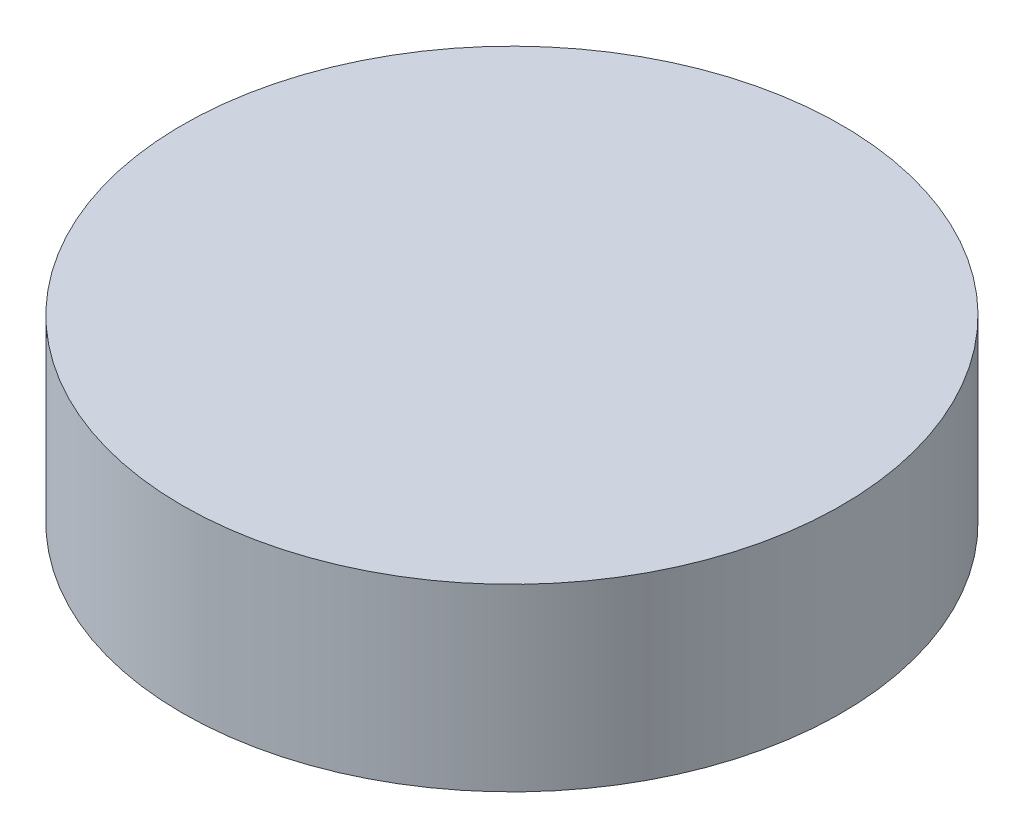
ISO-10303-21;
HEADER;
FILE_DESCRIPTION(('STEP AP214'),'2;1');
FILE_NAME('part.step','',(''),(''),'','','');
FILE_SCHEMA(('AUTOMOTIVE_DESIGN { 1 0 10303 214 1 1 1 1 }'));
ENDSEC;
DATA;
#1=APPLICATION_CONTEXT('core data for automotive mechanical design processes');
#2=APPLICATION_PROTOCOL_DEFINITION('international standard','automotive_design',2000,#1);
#3=PRODUCT_CONTEXT('',#1,'mechanical');
#4=PRODUCT('Part','Part','',(#3));
#5=PRODUCT_RELATED_PRODUCT_CATEGORY('part','',(#4));
#6=PRODUCT_DEFINITION_FORMATION('','',#4);
#7=PRODUCT_DEFINITION_CONTEXT('part definition',#1,'design');
#8=PRODUCT_DEFINITION('design','',#6,#7);
#9=PRODUCT_DEFINITION_SHAPE('','',#8);
#10=(LENGTH_UNIT() NAMED_UNIT(*) SI_UNIT(.MILLI.,.METRE.));
#11=(NAMED_UNIT(*) PLANE_ANGLE_UNIT() SI_UNIT($,.RADIAN.));
#12=(NAMED_UNIT(*) SI_UNIT($,.STERADIAN.) SOLID_ANGLE_UNIT());
#13=UNCERTAINTY_MEASURE_WITH_UNIT(LENGTH_MEASURE(1.E-05),#10,'distance_accuracy_value','');
#14=(GEOMETRIC_REPRESENTATION_CONTEXT(3) GLOBAL_UNCERTAINTY_ASSIGNED_CONTEXT((#13)) GLOBAL_UNIT_ASSIGNED_CONTEXT((#10,
#11,#12)) REPRESENTATION_CONTEXT('',''));
#15=CARTESIAN_POINT('',(0.,0.,0.));
#16=DIRECTION('',(0.,0.,1.));
#17=DIRECTION('',(1.,0.,0.));
#18=AXIS2_PLACEMENT_3D('',#15,#16,#17);
#19=CARTESIAN_POINT('',(0.,6.,0.));
#20=DIRECTION('',(0.,-1.,0.));
#21=DIRECTION('',(0.,0.,-1.));
#22=AXIS2_PLACEMENT_3D('',#19,#20,#21);
#23=CYLINDRICAL_SURFACE('',#22,11.);
#24=CARTESIAN_POINT('',(0.,6.,0.));
#25=DIRECTION('',(0.,1.,0.));
#26=DIRECTION('',(0.,0.,1.));
#27=AXIS2_PLACEMENT_3D('',#24,#25,#26);
#28=CIRCLE('',#27,11.);
#29=CARTESIAN_POINT('',(0.,6.,11.));
#30=VERTEX_POINT('',#29);
#31=EDGE_CURVE('E10',#30,#30,#28,.T.);
#32=ORIENTED_EDGE('',*,*,#31,.F.);
#33=EDGE_LOOP('',(#32));
#34=FACE_BOUND('',#33,.T.);
#35=CARTESIAN_POINT('',(0.,0.,0.));
#36=DIRECTION('',(0.,1.,0.));
#37=DIRECTION('',(0.,0.,1.));
#38=AXIS2_PLACEMENT_3D('',#35,#36,#37);
#39=CIRCLE('',#38,11.);
#40=CARTESIAN_POINT('',(0.,0.,11.));
#41=VERTEX_POINT('',#40);
#42=EDGE_CURVE('E34',#41,#41,#39,.T.);
#43=ORIENTED_EDGE('',*,*,#42,.T.);
#44=EDGE_LOOP('',(#43));
#45=FACE_BOUND('',#44,.T.);
#46=ADVANCED_FACE('F31',(#34,#45),#23,.T.);
#47=CARTESIAN_POINT('',(0.,6.,0.));
#48=DIRECTION('',(0.,1.,0.));
#49=DIRECTION('',(0.,0.,1.));
#50=AXIS2_PLACEMENT_3D('',#47,#48,#49);
#51=PLANE('',#50);
#52=ORIENTED_EDGE('',*,*,#31,.T.);
#53=EDGE_LOOP('',(#52));
#54=FACE_BOUND('',#53,.T.);
#55=ADVANCED_FACE('F46',(#54),#51,.T.);
#56=CARTESIAN_POINT('',(0.,0.,0.));
#57=DIRECTION('',(0.,1.,0.));
#58=DIRECTION('',(0.,0.,1.));
#59=AXIS2_PLACEMENT_3D('',#56,#57,#58);
#60=PLANE('',#59);
#61=ORIENTED_EDGE('',*,*,#42,.F.);
#62=EDGE_LOOP('',(#61));
#63=FACE_BOUND('',#62,.T.);
#64=ADVANCED_FACE('F44',(#63),#60,.F.);
#65=CLOSED_SHELL('',(#46,#55,#64));
#66=MANIFOLD_SOLID_BREP('B2',#65);
#67=ADVANCED_BREP_SHAPE_REPRESENTATION('',(#18,#66),#14);
#68=SHAPE_DEFINITION_REPRESENTATION(#9,#67);
ENDSEC;
END-ISO-10303-21;
